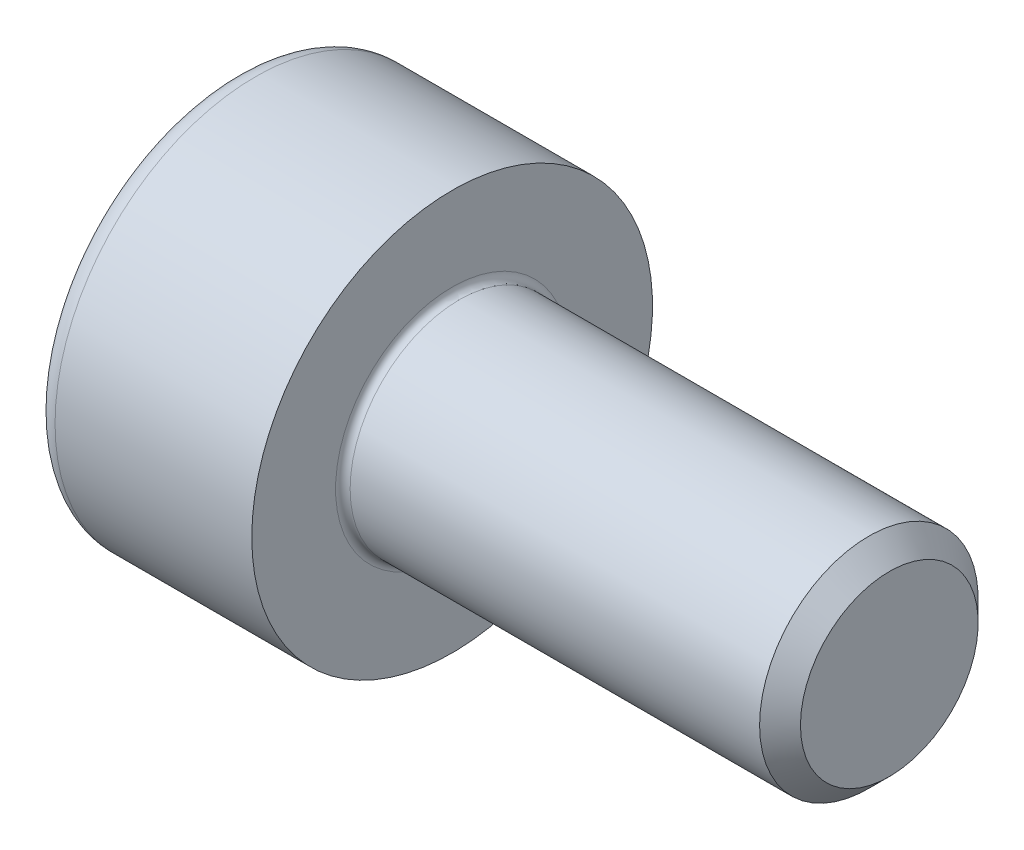
ISO-10303-21;
HEADER;
FILE_DESCRIPTION(('STEP AP214'),'2;1');
FILE_NAME('part.step','',(''),(''),'','','');
FILE_SCHEMA(('AUTOMOTIVE_DESIGN { 1 0 10303 214 1 1 1 1 }'));
ENDSEC;
DATA;
#1=APPLICATION_CONTEXT('core data for automotive mechanical design processes');
#2=APPLICATION_PROTOCOL_DEFINITION('international standard','automotive_design',2000,#1);
#3=PRODUCT_CONTEXT('',#1,'mechanical');
#4=PRODUCT('Part','Part','',(#3));
#5=PRODUCT_RELATED_PRODUCT_CATEGORY('part','',(#4));
#6=PRODUCT_DEFINITION_FORMATION('','',#4);
#7=PRODUCT_DEFINITION_CONTEXT('part definition',#1,'design');
#8=PRODUCT_DEFINITION('design','',#6,#7);
#9=PRODUCT_DEFINITION_SHAPE('','',#8);
#10=(LENGTH_UNIT() NAMED_UNIT(*) SI_UNIT(.MILLI.,.METRE.));
#11=(NAMED_UNIT(*) PLANE_ANGLE_UNIT() SI_UNIT($,.RADIAN.));
#12=(NAMED_UNIT(*) SI_UNIT($,.STERADIAN.) SOLID_ANGLE_UNIT());
#13=UNCERTAINTY_MEASURE_WITH_UNIT(LENGTH_MEASURE(1.E-05),#10,'distance_accuracy_value','');
#14=(GEOMETRIC_REPRESENTATION_CONTEXT(3) GLOBAL_UNCERTAINTY_ASSIGNED_CONTEXT((#13)) GLOBAL_UNIT_ASSIGNED_CONTEXT((#10,
#11,#12)) REPRESENTATION_CONTEXT('',''));
#15=CARTESIAN_POINT('',(0.,0.,0.));
#16=DIRECTION('',(0.,0.,1.));
#17=DIRECTION('',(1.,0.,0.));
#18=AXIS2_PLACEMENT_3D('',#15,#16,#17);
#19=CARTESIAN_POINT('',(0.,0.,0.));
#20=DIRECTION('',(-1.,0.,0.));
#21=DIRECTION('',(0.,0.,1.));
#22=AXIS2_PLACEMENT_3D('',#19,#20,#21);
#23=PLANE('',#22);
#24=DIRECTION('',(0.,-0.499999999999999,0.86602540378444));
#25=VECTOR('',#24,1.);
#26=CARTESIAN_POINT('',(0.,1.45492267835785,0.));
#27=LINE('',#26,#25);
#28=CARTESIAN_POINT('',(0.,1.45492267835785,0.));
#29=VERTEX_POINT('',#28);
#30=CARTESIAN_POINT('',(0.,0.727461339178924,1.26));
#31=VERTEX_POINT('',#30);
#32=EDGE_CURVE('E269',#29,#31,#27,.T.);
#33=ORIENTED_EDGE('',*,*,#32,.T.);
#34=DIRECTION('',(0.,1.,0.));
#35=VECTOR('',#34,1.);
#36=CARTESIAN_POINT('',(0.,-0.727461339178933,1.26));
#37=LINE('',#36,#35);
#38=CARTESIAN_POINT('',(0.,-0.727461339178933,1.26));
#39=VERTEX_POINT('',#38);
#40=EDGE_CURVE('E130',#39,#31,#37,.T.);
#41=ORIENTED_EDGE('',*,*,#40,.F.);
#42=DIRECTION('',(0.,-0.500000000000001,-0.866025403784438));
#43=VECTOR('',#42,1.);
#44=CARTESIAN_POINT('',(0.,-0.727461339178933,1.26));
#45=LINE('',#44,#43);
#46=CARTESIAN_POINT('',(0.,-1.45492267835786,0.));
#47=VERTEX_POINT('',#46);
#48=EDGE_CURVE('E272',#39,#47,#45,.T.);
#49=ORIENTED_EDGE('',*,*,#48,.T.);
#50=DIRECTION('',(0.,0.499999999999999,-0.866025403784439));
#51=VECTOR('',#50,1.);
#52=CARTESIAN_POINT('',(0.,-1.45492267835786,0.));
#53=LINE('',#52,#51);
#54=CARTESIAN_POINT('',(0.,-0.727461339178937,-1.26));
#55=VERTEX_POINT('',#54);
#56=EDGE_CURVE('E275',#47,#55,#53,.T.);
#57=ORIENTED_EDGE('',*,*,#56,.T.);
#58=DIRECTION('',(0.,-1.,0.));
#59=VECTOR('',#58,1.);
#60=CARTESIAN_POINT('',(0.,0.72746133917892,-1.26));
#61=LINE('',#60,#59);
#62=CARTESIAN_POINT('',(0.,0.72746133917892,-1.26));
#63=VERTEX_POINT('',#62);
#64=EDGE_CURVE('E278',#63,#55,#61,.T.);
#65=ORIENTED_EDGE('',*,*,#64,.F.);
#66=DIRECTION('',(0.,-0.500000000000001,-0.866025403784438));
#67=VECTOR('',#66,1.);
#68=CARTESIAN_POINT('',(0.,1.45492267835785,0.));
#69=LINE('',#68,#67);
#70=EDGE_CURVE('E125',#29,#63,#69,.T.);
#71=ORIENTED_EDGE('',*,*,#70,.F.);
#72=EDGE_LOOP('',(#33,#41,#49,#57,#65,#71));
#73=FACE_BOUND('',#72,.T.);
#74=CARTESIAN_POINT('',(0.,0.,0.));
#75=DIRECTION('',(-1.,0.,0.));
#76=DIRECTION('',(0.,0.,1.));
#77=AXIS2_PLACEMENT_3D('',#74,#75,#76);
#78=CIRCLE('',#77,2.45);
#79=CARTESIAN_POINT('',(0.,0.,2.45));
#80=VERTEX_POINT('',#79);
#81=EDGE_CURVE('E46',#80,#80,#78,.T.);
#82=ORIENTED_EDGE('',*,*,#81,.T.);
#83=EDGE_LOOP('',(#82));
#84=FACE_BOUND('',#83,.T.);
#85=ADVANCED_FACE('F38',(#73,#84),#23,.T.);
#86=CARTESIAN_POINT('',(-31.75,0.,0.));
#87=DIRECTION('',(-1.,0.,0.));
#88=DIRECTION('',(0.,0.,1.));
#89=AXIS2_PLACEMENT_3D('',#86,#87,#88);
#90=CYLINDRICAL_SURFACE('',#89,2.75);
#91=CARTESIAN_POINT('',(0.300000000000002,0.,0.));
#92=DIRECTION('',(-1.,0.,0.));
#93=DIRECTION('',(0.,0.,1.));
#94=AXIS2_PLACEMENT_3D('',#91,#92,#93);
#95=CIRCLE('',#94,2.75);
#96=CARTESIAN_POINT('',(0.300000000000002,0.,2.75));
#97=VERTEX_POINT('',#96);
#98=EDGE_CURVE('E11',#97,#97,#95,.F.);
#99=ORIENTED_EDGE('',*,*,#98,.T.);
#100=EDGE_LOOP('',(#99));
#101=FACE_BOUND('',#100,.T.);
#102=CARTESIAN_POINT('',(3.,0.,0.));
#103=DIRECTION('',(-1.,0.,0.));
#104=DIRECTION('',(0.,0.,1.));
#105=AXIS2_PLACEMENT_3D('',#102,#103,#104);
#106=CIRCLE('',#105,2.75);
#107=CARTESIAN_POINT('',(3.,0.,2.75));
#108=VERTEX_POINT('',#107);
#109=EDGE_CURVE('E148',#108,#108,#106,.T.);
#110=ORIENTED_EDGE('',*,*,#109,.T.);
#111=EDGE_LOOP('',(#110));
#112=FACE_BOUND('',#111,.T.);
#113=ADVANCED_FACE('F172',(#101,#112),#90,.T.);
#114=CARTESIAN_POINT('',(3.,2.75,0.));
#115=DIRECTION('',(1.,0.,0.));
#116=DIRECTION('',(0.,0.,-1.));
#117=AXIS2_PLACEMENT_3D('',#114,#115,#116);
#118=PLANE('',#117);
#119=CARTESIAN_POINT('',(3.,0.,0.));
#120=DIRECTION('',(1.,0.,0.));
#121=DIRECTION('',(0.,0.,-1.));
#122=AXIS2_PLACEMENT_3D('',#119,#120,#121);
#123=CIRCLE('',#122,1.6);
#124=CARTESIAN_POINT('',(3.,0.,-1.6));
#125=VERTEX_POINT('',#124);
#126=EDGE_CURVE('E151',#125,#125,#123,.F.);
#127=ORIENTED_EDGE('',*,*,#126,.T.);
#128=EDGE_LOOP('',(#127));
#129=FACE_BOUND('',#128,.T.);
#130=ORIENTED_EDGE('',*,*,#109,.F.);
#131=EDGE_LOOP('',(#130));
#132=FACE_BOUND('',#131,.T.);
#133=ADVANCED_FACE('F178',(#129,#132),#118,.T.);
#134=CARTESIAN_POINT('',(-31.75,0.,0.));
#135=DIRECTION('',(-1.,0.,0.));
#136=DIRECTION('',(0.,0.,1.));
#137=AXIS2_PLACEMENT_3D('',#134,#135,#136);
#138=CYLINDRICAL_SURFACE('',#137,1.5);
#139=CARTESIAN_POINT('',(3.1,0.,0.));
#140=DIRECTION('',(1.,0.,0.));
#141=DIRECTION('',(0.,0.,-1.));
#142=AXIS2_PLACEMENT_3D('',#139,#140,#141);
#143=CIRCLE('',#142,1.5);
#144=CARTESIAN_POINT('',(3.1,0.,-1.5));
#145=VERTEX_POINT('',#144);
#146=EDGE_CURVE('E154',#145,#145,#143,.T.);
#147=ORIENTED_EDGE('',*,*,#146,.T.);
#148=EDGE_LOOP('',(#147));
#149=FACE_BOUND('',#148,.T.);
#150=CARTESIAN_POINT('',(8.71950000000001,0.,0.));
#151=DIRECTION('',(-1.,0.,0.));
#152=DIRECTION('',(0.,0.,1.));
#153=AXIS2_PLACEMENT_3D('',#150,#151,#152);
#154=CIRCLE('',#153,1.5);
#155=CARTESIAN_POINT('',(8.71950000000001,0.,1.5));
#156=VERTEX_POINT('',#155);
#157=EDGE_CURVE('E145',#156,#156,#154,.T.);
#158=ORIENTED_EDGE('',*,*,#157,.T.);
#159=EDGE_LOOP('',(#158));
#160=FACE_BOUND('',#159,.T.);
#161=ADVANCED_FACE('F184',(#149,#160),#138,.T.);
#162=CARTESIAN_POINT('',(9.,0.,0.));
#163=DIRECTION('',(-1.,0.,0.));
#164=DIRECTION('',(0.,0.,1.));
#165=AXIS2_PLACEMENT_3D('',#162,#163,#164);
#166=CONICAL_SURFACE('',#165,1.2195,0.785398163397455);
#167=ORIENTED_EDGE('',*,*,#157,.F.);
#168=EDGE_LOOP('',(#167));
#169=FACE_BOUND('',#168,.T.);
#170=CARTESIAN_POINT('',(9.,0.,0.));
#171=DIRECTION('',(-1.,0.,0.));
#172=DIRECTION('',(0.,0.,1.));
#173=AXIS2_PLACEMENT_3D('',#170,#171,#172);
#174=CIRCLE('',#173,1.2195);
#175=CARTESIAN_POINT('',(9.,0.,1.2195));
#176=VERTEX_POINT('',#175);
#177=EDGE_CURVE('E141',#176,#176,#174,.T.);
#178=ORIENTED_EDGE('',*,*,#177,.T.);
#179=EDGE_LOOP('',(#178));
#180=FACE_BOUND('',#179,.T.);
#181=ADVANCED_FACE('F188',(#169,#180),#166,.T.);
#182=CARTESIAN_POINT('',(9.,1.2195,0.));
#183=DIRECTION('',(1.,0.,0.));
#184=DIRECTION('',(0.,0.,-1.));
#185=AXIS2_PLACEMENT_3D('',#182,#183,#184);
#186=PLANE('',#185);
#187=ORIENTED_EDGE('',*,*,#177,.F.);
#188=EDGE_LOOP('',(#187));
#189=FACE_BOUND('',#188,.T.);
#190=ADVANCED_FACE('F168',(#189),#186,.T.);
#191=CARTESIAN_POINT('',(3.1,0.,0.));
#192=DIRECTION('',(1.,0.,0.));
#193=DIRECTION('',(0.,0.,-1.));
#194=AXIS2_PLACEMENT_3D('',#191,#192,#193);
#195=TOROIDAL_SURFACE('',#194,1.6,0.1);
#196=ORIENTED_EDGE('',*,*,#146,.F.);
#197=EDGE_LOOP('',(#196));
#198=FACE_BOUND('',#197,.T.);
#199=ORIENTED_EDGE('',*,*,#126,.F.);
#200=EDGE_LOOP('',(#199));
#201=FACE_BOUND('',#200,.T.);
#202=ADVANCED_FACE('F161',(#198,#201),#195,.F.);
#203=CARTESIAN_POINT('',(0.300000000000002,0.,0.));
#204=DIRECTION('',(-1.,0.,0.));
#205=DIRECTION('',(0.,0.,1.));
#206=AXIS2_PLACEMENT_3D('',#203,#204,#205);
#207=TOROIDAL_SURFACE('',#206,2.45,0.3);
#208=ORIENTED_EDGE('',*,*,#98,.F.);
#209=EDGE_LOOP('',(#208));
#210=FACE_BOUND('',#209,.T.);
#211=ORIENTED_EDGE('',*,*,#81,.F.);
#212=EDGE_LOOP('',(#211));
#213=FACE_BOUND('',#212,.T.);
#214=ADVANCED_FACE('F40',(#210,#213),#207,.T.);
#215=CARTESIAN_POINT('',(1.3,1.45492267835785,0.));
#216=DIRECTION('',(0.,-0.86602540378444,-0.499999999999999));
#217=DIRECTION('',(0.,0.499999999999999,-0.86602540378444));
#218=AXIS2_PLACEMENT_3D('',#215,#216,#217);
#219=PLANE('',#218);
#220=ORIENTED_EDGE('',*,*,#32,.F.);
#221=DIRECTION('',(-1.,0.,0.));
#222=VECTOR('',#221,1.);
#223=CARTESIAN_POINT('',(1.3,1.45492267835785,0.));
#224=LINE('',#223,#222);
#225=CARTESIAN_POINT('',(1.3,1.45492267835785,0.));
#226=VERTEX_POINT('',#225);
#227=EDGE_CURVE('E268',#226,#29,#224,.T.);
#228=ORIENTED_EDGE('',*,*,#227,.F.);
#229=DIRECTION('',(0.,-0.499999999999999,0.86602540378444));
#230=VECTOR('',#229,1.);
#231=CARTESIAN_POINT('',(1.3,1.45492267835785,0.));
#232=LINE('',#231,#230);
#233=CARTESIAN_POINT('',(1.3,1.09119200876839,0.629999999999998));
#234=VERTEX_POINT('',#233);
#235=EDGE_CURVE('E53',#226,#234,#232,.T.);
#236=ORIENTED_EDGE('',*,*,#235,.T.);
#237=CARTESIAN_POINT('',(1.3,0.727461339178924,1.26));
#238=VERTEX_POINT('',#237);
#239=EDGE_CURVE('E111',#234,#238,#232,.T.);
#240=ORIENTED_EDGE('',*,*,#239,.T.);
#241=DIRECTION('',(-1.,0.,0.));
#242=VECTOR('',#241,1.);
#243=CARTESIAN_POINT('',(1.3,0.727461339178924,1.26));
#244=LINE('',#243,#242);
#245=EDGE_CURVE('E123',#238,#31,#244,.T.);
#246=ORIENTED_EDGE('',*,*,#245,.T.);
#247=EDGE_LOOP('',(#220,#228,#236,#240,#246));
#248=FACE_BOUND('',#247,.T.);
#249=ADVANCED_FACE('F122',(#248),#219,.T.);
#250=CARTESIAN_POINT('',(1.3,-0.727461339178933,1.26));
#251=DIRECTION('',(0.,0.,1.));
#252=DIRECTION('',(0.,-1.,0.));
#253=AXIS2_PLACEMENT_3D('',#250,#251,#252);
#254=PLANE('',#253);
#255=ORIENTED_EDGE('',*,*,#40,.T.);
#256=ORIENTED_EDGE('',*,*,#245,.F.);
#257=DIRECTION('',(0.,1.,0.));
#258=VECTOR('',#257,1.);
#259=CARTESIAN_POINT('',(1.3,-0.727461339178933,1.26));
#260=LINE('',#259,#258);
#261=CARTESIAN_POINT('',(1.3,0.,1.26));
#262=VERTEX_POINT('',#261);
#263=EDGE_CURVE('E109',#262,#238,#260,.T.);
#264=ORIENTED_EDGE('',*,*,#263,.F.);
#265=CARTESIAN_POINT('',(1.3,-0.727461339178933,1.26));
#266=VERTEX_POINT('',#265);
#267=EDGE_CURVE('E119',#266,#262,#260,.T.);
#268=ORIENTED_EDGE('',*,*,#267,.F.);
#269=DIRECTION('',(-1.,0.,0.));
#270=VECTOR('',#269,1.);
#271=CARTESIAN_POINT('',(1.3,-0.727461339178933,1.26));
#272=LINE('',#271,#270);
#273=EDGE_CURVE('E132',#266,#39,#272,.T.);
#274=ORIENTED_EDGE('',*,*,#273,.T.);
#275=EDGE_LOOP('',(#255,#256,#264,#268,#274));
#276=FACE_BOUND('',#275,.T.);
#277=ADVANCED_FACE('F127',(#276),#254,.F.);
#278=CARTESIAN_POINT('',(1.3,-0.727461339178933,1.26));
#279=DIRECTION('',(0.,0.866025403784438,-0.500000000000001));
#280=DIRECTION('',(0.,0.500000000000001,0.866025403784438));
#281=AXIS2_PLACEMENT_3D('',#278,#279,#280);
#282=PLANE('',#281);
#283=ORIENTED_EDGE('',*,*,#48,.F.);
#284=ORIENTED_EDGE('',*,*,#273,.F.);
#285=DIRECTION('',(0.,-0.500000000000001,-0.866025403784438));
#286=VECTOR('',#285,1.);
#287=CARTESIAN_POINT('',(1.3,-0.727461339178933,1.26));
#288=LINE('',#287,#286);
#289=CARTESIAN_POINT('',(1.3,-1.0911920087684,0.630000000000004));
#290=VERTEX_POINT('',#289);
#291=EDGE_CURVE('E249',#266,#290,#288,.T.);
#292=ORIENTED_EDGE('',*,*,#291,.T.);
#293=CARTESIAN_POINT('',(1.3,-1.45492267835786,0.));
#294=VERTEX_POINT('',#293);
#295=EDGE_CURVE('E251',#290,#294,#288,.T.);
#296=ORIENTED_EDGE('',*,*,#295,.T.);
#297=DIRECTION('',(-1.,0.,0.));
#298=VECTOR('',#297,1.);
#299=CARTESIAN_POINT('',(1.3,-1.45492267835786,0.));
#300=LINE('',#299,#298);
#301=EDGE_CURVE('E137',#294,#47,#300,.T.);
#302=ORIENTED_EDGE('',*,*,#301,.T.);
#303=EDGE_LOOP('',(#283,#284,#292,#296,#302));
#304=FACE_BOUND('',#303,.T.);
#305=ADVANCED_FACE('F201',(#304),#282,.T.);
#306=CARTESIAN_POINT('',(1.3,-1.45492267835786,0.));
#307=DIRECTION('',(0.,0.866025403784439,0.499999999999999));
#308=DIRECTION('',(0.,-0.499999999999999,0.866025403784439));
#309=AXIS2_PLACEMENT_3D('',#306,#307,#308);
#310=PLANE('',#309);
#311=ORIENTED_EDGE('',*,*,#56,.F.);
#312=ORIENTED_EDGE('',*,*,#301,.F.);
#313=DIRECTION('',(0.,0.499999999999999,-0.866025403784439));
#314=VECTOR('',#313,1.);
#315=CARTESIAN_POINT('',(1.3,-1.45492267835786,0.));
#316=LINE('',#315,#314);
#317=CARTESIAN_POINT('',(1.3,-1.0911920087684,-0.630000000000001));
#318=VERTEX_POINT('',#317);
#319=EDGE_CURVE('E254',#294,#318,#316,.T.);
#320=ORIENTED_EDGE('',*,*,#319,.T.);
#321=CARTESIAN_POINT('',(1.3,-0.727461339178937,-1.26));
#322=VERTEX_POINT('',#321);
#323=EDGE_CURVE('E258',#318,#322,#316,.T.);
#324=ORIENTED_EDGE('',*,*,#323,.T.);
#325=DIRECTION('',(-1.,0.,0.));
#326=VECTOR('',#325,1.);
#327=CARTESIAN_POINT('',(1.3,-0.727461339178937,-1.26));
#328=LINE('',#327,#326);
#329=EDGE_CURVE('E287',#322,#55,#328,.T.);
#330=ORIENTED_EDGE('',*,*,#329,.T.);
#331=EDGE_LOOP('',(#311,#312,#320,#324,#330));
#332=FACE_BOUND('',#331,.T.);
#333=ADVANCED_FACE('F204',(#332),#310,.T.);
#334=CARTESIAN_POINT('',(1.3,0.72746133917892,-1.26));
#335=DIRECTION('',(0.,0.,-1.));
#336=DIRECTION('',(0.,1.,0.));
#337=AXIS2_PLACEMENT_3D('',#334,#335,#336);
#338=PLANE('',#337);
#339=ORIENTED_EDGE('',*,*,#64,.T.);
#340=ORIENTED_EDGE('',*,*,#329,.F.);
#341=DIRECTION('',(0.,-1.,0.));
#342=VECTOR('',#341,1.);
#343=CARTESIAN_POINT('',(1.3,0.72746133917892,-1.26));
#344=LINE('',#343,#342);
#345=CARTESIAN_POINT('',(1.3,0.,-1.26));
#346=VERTEX_POINT('',#345);
#347=EDGE_CURVE('E262',#346,#322,#344,.T.);
#348=ORIENTED_EDGE('',*,*,#347,.F.);
#349=CARTESIAN_POINT('',(1.3,0.72746133917892,-1.26));
#350=VERTEX_POINT('',#349);
#351=EDGE_CURVE('E263',#350,#346,#344,.T.);
#352=ORIENTED_EDGE('',*,*,#351,.F.);
#353=DIRECTION('',(-1.,0.,0.));
#354=VECTOR('',#353,1.);
#355=CARTESIAN_POINT('',(1.3,0.72746133917892,-1.26));
#356=LINE('',#355,#354);
#357=EDGE_CURVE('E284',#350,#63,#356,.T.);
#358=ORIENTED_EDGE('',*,*,#357,.T.);
#359=EDGE_LOOP('',(#339,#340,#348,#352,#358));
#360=FACE_BOUND('',#359,.T.);
#361=ADVANCED_FACE('F208',(#360),#338,.F.);
#362=CARTESIAN_POINT('',(1.3,1.45492267835785,0.));
#363=DIRECTION('',(0.,0.866025403784438,-0.500000000000001));
#364=DIRECTION('',(0.,0.500000000000001,0.866025403784438));
#365=AXIS2_PLACEMENT_3D('',#362,#363,#364);
#366=PLANE('',#365);
#367=ORIENTED_EDGE('',*,*,#70,.T.);
#368=ORIENTED_EDGE('',*,*,#357,.F.);
#369=DIRECTION('',(0.,-0.500000000000001,-0.866025403784438));
#370=VECTOR('',#369,1.);
#371=CARTESIAN_POINT('',(1.3,1.45492267835785,0.));
#372=LINE('',#371,#370);
#373=CARTESIAN_POINT('',(1.3,1.09119200876839,-0.629999999999999));
#374=VERTEX_POINT('',#373);
#375=EDGE_CURVE('E266',#374,#350,#372,.T.);
#376=ORIENTED_EDGE('',*,*,#375,.F.);
#377=EDGE_CURVE('E240',#226,#374,#372,.T.);
#378=ORIENTED_EDGE('',*,*,#377,.F.);
#379=ORIENTED_EDGE('',*,*,#227,.T.);
#380=EDGE_LOOP('',(#367,#368,#376,#378,#379));
#381=FACE_BOUND('',#380,.T.);
#382=ADVANCED_FACE('F212',(#381),#366,.F.);
#383=CARTESIAN_POINT('',(1.3,0.727461339178924,1.26));
#384=DIRECTION('',(-1.,0.,0.));
#385=DIRECTION('',(0.,0.,1.));
#386=AXIS2_PLACEMENT_3D('',#383,#384,#385);
#387=PLANE('',#386);
#388=CARTESIAN_POINT('',(1.3,0.,0.));
#389=DIRECTION('',(-1.,0.,0.));
#390=DIRECTION('',(0.,0.,1.));
#391=AXIS2_PLACEMENT_3D('',#388,#389,#390);
#392=CIRCLE('',#391,1.26);
#393=EDGE_CURVE('E131',#290,#262,#392,.T.);
#394=ORIENTED_EDGE('',*,*,#393,.F.);
#395=ORIENTED_EDGE('',*,*,#291,.F.);
#396=ORIENTED_EDGE('',*,*,#267,.T.);
#397=EDGE_LOOP('',(#394,#395,#396));
#398=FACE_BOUND('',#397,.T.);
#399=ADVANCED_FACE('F216',(#398),#387,.T.);
#400=EDGE_CURVE('E135',#318,#290,#392,.T.);
#401=ORIENTED_EDGE('',*,*,#400,.F.);
#402=ORIENTED_EDGE('',*,*,#319,.F.);
#403=ORIENTED_EDGE('',*,*,#295,.F.);
#404=EDGE_LOOP('',(#401,#402,#403));
#405=FACE_BOUND('',#404,.T.);
#406=ADVANCED_FACE('F219',(#405),#387,.T.);
#407=EDGE_CURVE('E293',#346,#318,#392,.T.);
#408=ORIENTED_EDGE('',*,*,#407,.F.);
#409=ORIENTED_EDGE('',*,*,#347,.T.);
#410=ORIENTED_EDGE('',*,*,#323,.F.);
#411=EDGE_LOOP('',(#408,#409,#410));
#412=FACE_BOUND('',#411,.T.);
#413=ADVANCED_FACE('F224',(#412),#387,.T.);
#414=EDGE_CURVE('E243',#374,#346,#392,.T.);
#415=ORIENTED_EDGE('',*,*,#414,.F.);
#416=ORIENTED_EDGE('',*,*,#375,.T.);
#417=ORIENTED_EDGE('',*,*,#351,.T.);
#418=EDGE_LOOP('',(#415,#416,#417));
#419=FACE_BOUND('',#418,.T.);
#420=ADVANCED_FACE('F231',(#419),#387,.T.);
#421=EDGE_CURVE('E142',#234,#374,#392,.T.);
#422=ORIENTED_EDGE('',*,*,#421,.F.);
#423=ORIENTED_EDGE('',*,*,#235,.F.);
#424=ORIENTED_EDGE('',*,*,#377,.T.);
#425=EDGE_LOOP('',(#422,#423,#424));
#426=FACE_BOUND('',#425,.T.);
#427=ADVANCED_FACE('F227',(#426),#387,.T.);
#428=EDGE_CURVE('E114',#262,#234,#392,.T.);
#429=ORIENTED_EDGE('',*,*,#428,.F.);
#430=ORIENTED_EDGE('',*,*,#263,.T.);
#431=ORIENTED_EDGE('',*,*,#239,.F.);
#432=EDGE_LOOP('',(#429,#430,#431));
#433=FACE_BOUND('',#432,.T.);
#434=ADVANCED_FACE('F110',(#433),#387,.T.);
#435=CARTESIAN_POINT('',(1.3,0.,0.));
#436=DIRECTION('',(-1.,0.,0.));
#437=DIRECTION('',(0.,0.,1.));
#438=AXIS2_PLACEMENT_3D('',#435,#436,#437);
#439=CONICAL_SURFACE('',#438,1.26,1.04719755119659);
#440=CARTESIAN_POINT('',(2.02746133917894,0.,0.));
#441=VERTEX_POINT('',#440);
#442=VERTEX_LOOP('',#441);
#443=FACE_BOUND('',#442,.T.);
#444=ORIENTED_EDGE('',*,*,#428,.T.);
#445=ORIENTED_EDGE('',*,*,#421,.T.);
#446=ORIENTED_EDGE('',*,*,#414,.T.);
#447=ORIENTED_EDGE('',*,*,#407,.T.);
#448=ORIENTED_EDGE('',*,*,#400,.T.);
#449=ORIENTED_EDGE('',*,*,#393,.T.);
#450=EDGE_LOOP('',(#444,#445,#446,#447,#448,#449));
#451=FACE_BOUND('',#450,.T.);
#452=ADVANCED_FACE('F196',(#443,#451),#439,.F.);
#453=CLOSED_SHELL('',(#85,#113,#133,#161,#181,#190,#202,#214,#249,#277,#305,#333,#361,#382,#399,
#406,#413,#420,#427,#434,#452));
#454=MANIFOLD_SOLID_BREP('B2',#453);
#455=ADVANCED_BREP_SHAPE_REPRESENTATION('',(#18,#454),#14);
#456=SHAPE_DEFINITION_REPRESENTATION(#9,#455);
ENDSEC;
END-ISO-10303-21;
